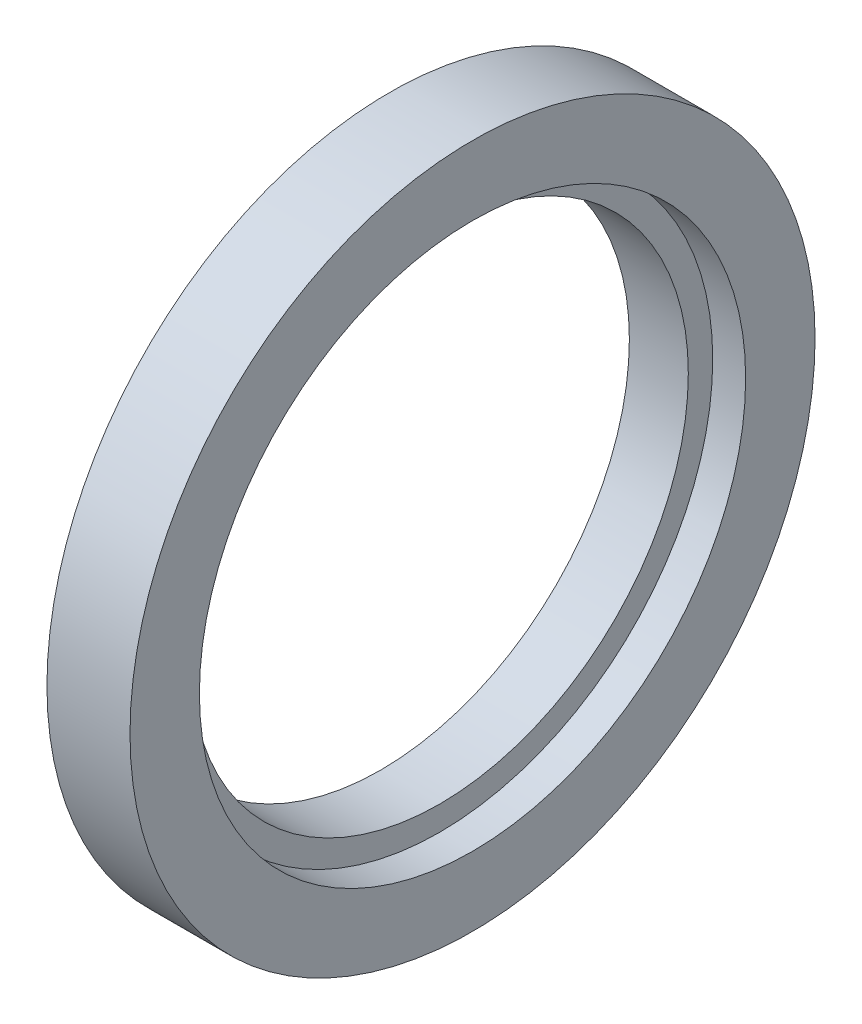
ISO-10303-21;
HEADER;
FILE_DESCRIPTION(('STEP AP214'),'2;1');
FILE_NAME('part.step','',(''),(''),'','','');
FILE_SCHEMA(('AUTOMOTIVE_DESIGN { 1 0 10303 214 1 1 1 1 }'));
ENDSEC;
DATA;
#1=APPLICATION_CONTEXT('core data for automotive mechanical design processes');
#2=APPLICATION_PROTOCOL_DEFINITION('international standard','automotive_design',2000,#1);
#3=PRODUCT_CONTEXT('',#1,'mechanical');
#4=PRODUCT('Part','Part','',(#3));
#5=PRODUCT_RELATED_PRODUCT_CATEGORY('part','',(#4));
#6=PRODUCT_DEFINITION_FORMATION('','',#4);
#7=PRODUCT_DEFINITION_CONTEXT('part definition',#1,'design');
#8=PRODUCT_DEFINITION('design','',#6,#7);
#9=PRODUCT_DEFINITION_SHAPE('','',#8);
#10=(LENGTH_UNIT() NAMED_UNIT(*) SI_UNIT(.MILLI.,.METRE.));
#11=(NAMED_UNIT(*) PLANE_ANGLE_UNIT() SI_UNIT($,.RADIAN.));
#12=(NAMED_UNIT(*) SI_UNIT($,.STERADIAN.) SOLID_ANGLE_UNIT());
#13=UNCERTAINTY_MEASURE_WITH_UNIT(LENGTH_MEASURE(1.E-05),#10,'distance_accuracy_value','');
#14=(GEOMETRIC_REPRESENTATION_CONTEXT(3) GLOBAL_UNCERTAINTY_ASSIGNED_CONTEXT((#13)) GLOBAL_UNIT_ASSIGNED_CONTEXT((#10,
#11,#12)) REPRESENTATION_CONTEXT('',''));
#15=CARTESIAN_POINT('',(0.,0.,0.));
#16=DIRECTION('',(0.,0.,1.));
#17=DIRECTION('',(1.,0.,0.));
#18=AXIS2_PLACEMENT_3D('',#15,#16,#17);
#19=CARTESIAN_POINT('',(2.0692999999999,0.,0.));
#20=DIRECTION('',(1.,0.,0.));
#21=DIRECTION('',(0.,0.,-1.));
#22=AXIS2_PLACEMENT_3D('',#19,#20,#21);
#23=CYLINDRICAL_SURFACE('',#22,17.4624999999999);
#24=CARTESIAN_POINT('',(4.13859999999983,0.,0.));
#25=DIRECTION('',(1.,0.,0.));
#26=DIRECTION('',(0.,0.,-1.));
#27=AXIS2_PLACEMENT_3D('',#24,#25,#26);
#28=CIRCLE('',#27,17.4624999999999);
#29=CARTESIAN_POINT('',(4.13859999999983,0.,-17.4624999999999));
#30=VERTEX_POINT('',#29);
#31=EDGE_CURVE('E17',#30,#30,#28,.F.);
#32=ORIENTED_EDGE('',*,*,#31,.F.);
#33=EDGE_LOOP('',(#32));
#34=FACE_BOUND('',#33,.T.);
#35=CARTESIAN_POINT('',(0.,0.,0.));
#36=DIRECTION('',(1.,0.,0.));
#37=DIRECTION('',(0.,0.,-1.));
#38=AXIS2_PLACEMENT_3D('',#35,#36,#37);
#39=CIRCLE('',#38,17.4624999999999);
#40=CARTESIAN_POINT('',(0.,0.,-17.4624999999999));
#41=VERTEX_POINT('',#40);
#42=EDGE_CURVE('E43',#41,#41,#39,.T.);
#43=ORIENTED_EDGE('',*,*,#42,.F.);
#44=EDGE_LOOP('',(#43));
#45=FACE_BOUND('',#44,.T.);
#46=ADVANCED_FACE('F14',(#34,#45),#23,.F.);
#47=CARTESIAN_POINT('',(4.13859999999983,18.3197499999999,0.));
#48=DIRECTION('',(1.,0.,0.));
#49=DIRECTION('',(0.,0.,-1.));
#50=AXIS2_PLACEMENT_3D('',#47,#48,#49);
#51=PLANE('',#50);
#52=ORIENTED_EDGE('',*,*,#31,.T.);
#53=EDGE_LOOP('',(#52));
#54=FACE_BOUND('',#53,.T.);
#55=CARTESIAN_POINT('',(4.13859999999983,0.,0.));
#56=DIRECTION('',(1.,0.,0.));
#57=DIRECTION('',(0.,0.,-1.));
#58=AXIS2_PLACEMENT_3D('',#55,#56,#57);
#59=CIRCLE('',#58,19.1769999999999);
#60=CARTESIAN_POINT('',(4.13859999999983,0.,-19.1769999999999));
#61=VERTEX_POINT('',#60);
#62=EDGE_CURVE('E41',#61,#61,#59,.T.);
#63=ORIENTED_EDGE('',*,*,#62,.T.);
#64=EDGE_LOOP('',(#63));
#65=FACE_BOUND('',#64,.T.);
#66=ADVANCED_FACE('F50',(#54,#65),#51,.T.);
#67=CARTESIAN_POINT('',(0.,19.2062500000005,0.));
#68=DIRECTION('',(-1.,0.,0.));
#69=DIRECTION('',(0.,0.,1.));
#70=AXIS2_PLACEMENT_3D('',#67,#68,#69);
#71=PLANE('',#70);
#72=ORIENTED_EDGE('',*,*,#42,.T.);
#73=EDGE_LOOP('',(#72));
#74=FACE_BOUND('',#73,.T.);
#75=CARTESIAN_POINT('',(0.,0.,0.));
#76=DIRECTION('',(1.,0.,0.));
#77=DIRECTION('',(0.,0.,-1.));
#78=AXIS2_PLACEMENT_3D('',#75,#76,#77);
#79=CIRCLE('',#78,20.950000000001);
#80=CARTESIAN_POINT('',(0.,0.,-20.950000000001));
#81=VERTEX_POINT('',#80);
#82=EDGE_CURVE('E38',#81,#81,#79,.F.);
#83=ORIENTED_EDGE('',*,*,#82,.T.);
#84=EDGE_LOOP('',(#83));
#85=FACE_BOUND('',#84,.T.);
#86=ADVANCED_FACE('F61',(#74,#85),#71,.T.);
#87=CARTESIAN_POINT('',(5.29429999999922,0.,0.));
#88=DIRECTION('',(1.,0.,0.));
#89=DIRECTION('',(0.,0.,-1.));
#90=AXIS2_PLACEMENT_3D('',#87,#88,#89);
#91=CYLINDRICAL_SURFACE('',#90,19.1769999999999);
#92=CARTESIAN_POINT('',(6.44999999999861,0.,0.));
#93=DIRECTION('',(1.,0.,0.));
#94=DIRECTION('',(0.,0.,-1.));
#95=AXIS2_PLACEMENT_3D('',#92,#93,#94);
#96=CIRCLE('',#95,19.1769999999999);
#97=CARTESIAN_POINT('',(6.44999999999861,0.,-19.1769999999999));
#98=VERTEX_POINT('',#97);
#99=EDGE_CURVE('E33',#98,#98,#96,.F.);
#100=ORIENTED_EDGE('',*,*,#99,.F.);
#101=EDGE_LOOP('',(#100));
#102=FACE_BOUND('',#101,.T.);
#103=ORIENTED_EDGE('',*,*,#62,.F.);
#104=EDGE_LOOP('',(#103));
#105=FACE_BOUND('',#104,.T.);
#106=ADVANCED_FACE('F82',(#102,#105),#91,.F.);
#107=CARTESIAN_POINT('',(-0.255000000000098,0.,0.));
#108=DIRECTION('',(1.,0.,0.));
#109=DIRECTION('',(0.,0.,-1.));
#110=AXIS2_PLACEMENT_3D('',#107,#108,#109);
#111=CYLINDRICAL_SURFACE('',#110,20.950000000001);
#112=ORIENTED_EDGE('',*,*,#82,.F.);
#113=EDGE_LOOP('',(#112));
#114=FACE_BOUND('',#113,.T.);
#115=CARTESIAN_POINT('',(-0.510000002164026,0.,0.));
#116=DIRECTION('',(1.,0.,0.));
#117=DIRECTION('',(0.,1.,0.));
#118=AXIS2_PLACEMENT_3D('',#115,#116,#117);
#119=CIRCLE('',#118,20.9500000007886);
#120=CARTESIAN_POINT('',(-0.510000002164026,20.9500000007886,0.));
#121=VERTEX_POINT('',#120);
#122=EDGE_CURVE('E26',#121,#121,#119,.T.);
#123=ORIENTED_EDGE('',*,*,#122,.F.);
#124=EDGE_LOOP('',(#123));
#125=FACE_BOUND('',#124,.T.);
#126=ADVANCED_FACE('F78',(#114,#125),#111,.F.);
#127=CARTESIAN_POINT('',(6.44999999999861,21.6135000000001,0.));
#128=DIRECTION('',(1.,0.,0.));
#129=DIRECTION('',(0.,0.,-1.));
#130=AXIS2_PLACEMENT_3D('',#127,#128,#129);
#131=PLANE('',#130);
#132=ORIENTED_EDGE('',*,*,#99,.T.);
#133=EDGE_LOOP('',(#132));
#134=FACE_BOUND('',#133,.T.);
#135=CARTESIAN_POINT('',(6.44999999999861,0.,0.));
#136=DIRECTION('',(1.,0.,0.));
#137=DIRECTION('',(0.,0.,-1.));
#138=AXIS2_PLACEMENT_3D('',#135,#136,#137);
#139=CIRCLE('',#138,24.0500000000003);
#140=CARTESIAN_POINT('',(6.44999999999861,0.,-24.0500000000003));
#141=VERTEX_POINT('',#140);
#142=EDGE_CURVE('E21',#141,#141,#139,.F.);
#143=ORIENTED_EDGE('',*,*,#142,.F.);
#144=EDGE_LOOP('',(#143));
#145=FACE_BOUND('',#144,.T.);
#146=ADVANCED_FACE('F71',(#134,#145),#131,.T.);
#147=CARTESIAN_POINT('',(0.618307728388946,0.,0.));
#148=DIRECTION('',(1.,0.,0.));
#149=DIRECTION('',(0.,0.,-1.));
#150=AXIS2_PLACEMENT_3D('',#147,#148,#149);
#151=CONICAL_SURFACE('',#150,24.0499999992128,1.22173047499991);
#152=ORIENTED_EDGE('',*,*,#122,.T.);
#153=EDGE_LOOP('',(#152));
#154=FACE_BOUND('',#153,.T.);
#155=CARTESIAN_POINT('',(0.618307726225102,0.,0.));
#156=DIRECTION('',(1.,0.,0.));
#157=DIRECTION('',(0.,0.,-1.));
#158=AXIS2_PLACEMENT_3D('',#155,#156,#157);
#159=CIRCLE('',#158,24.0500000000003);
#160=CARTESIAN_POINT('',(0.618307726225102,0.,-24.0500000000003));
#161=VERTEX_POINT('',#160);
#162=EDGE_CURVE('E10',#161,#161,#159,.T.);
#163=ORIENTED_EDGE('',*,*,#162,.F.);
#164=EDGE_LOOP('',(#163));
#165=FACE_BOUND('',#164,.T.);
#166=ADVANCED_FACE('F64',(#154,#165),#151,.T.);
#167=CARTESIAN_POINT('',(3.53415386311184,0.,0.));
#168=DIRECTION('',(1.,0.,0.));
#169=DIRECTION('',(0.,0.,-1.));
#170=AXIS2_PLACEMENT_3D('',#167,#168,#169);
#171=CYLINDRICAL_SURFACE('',#170,24.0500000000003);
#172=ORIENTED_EDGE('',*,*,#162,.T.);
#173=EDGE_LOOP('',(#172));
#174=FACE_BOUND('',#173,.T.);
#175=ORIENTED_EDGE('',*,*,#142,.T.);
#176=EDGE_LOOP('',(#175));
#177=FACE_BOUND('',#176,.T.);
#178=ADVANCED_FACE('F62',(#174,#177),#171,.T.);
#179=CLOSED_SHELL('',(#46,#66,#86,#106,#126,#146,#166,#178));
#180=MANIFOLD_SOLID_BREP('B1',#179);
#181=ADVANCED_BREP_SHAPE_REPRESENTATION('',(#18,#180),#14);
#182=SHAPE_DEFINITION_REPRESENTATION(#9,#181);
ENDSEC;
END-ISO-10303-21;
